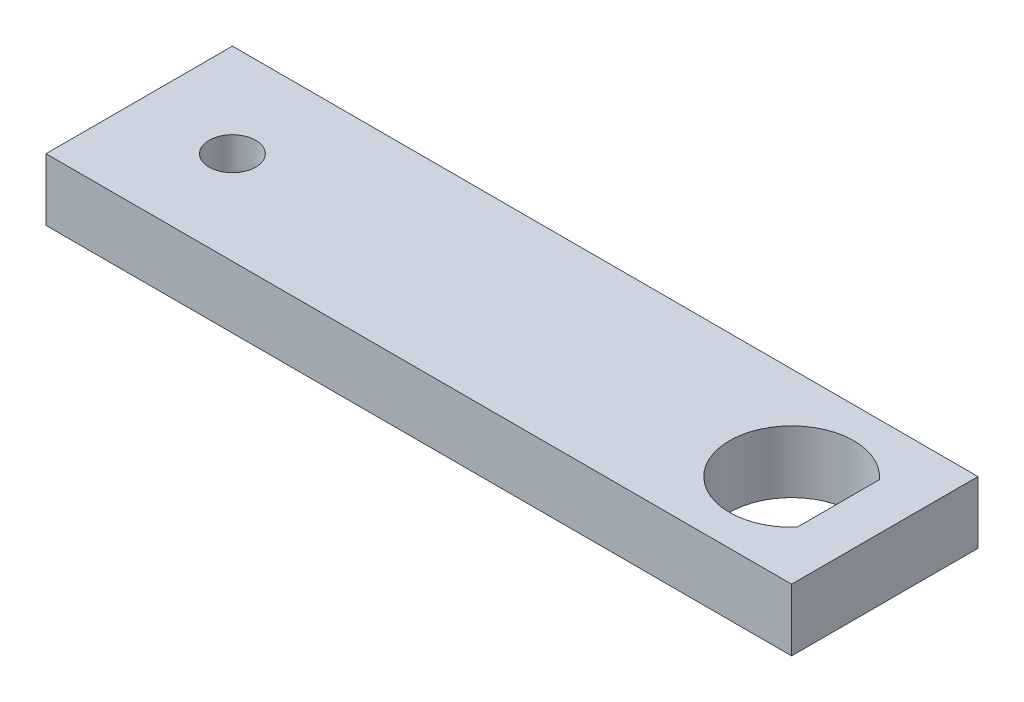
ISO-10303-21;
HEADER;
FILE_DESCRIPTION(('STEP AP214'),'2;1');
FILE_NAME('part.step','',(''),(''),'','','');
FILE_SCHEMA(('AUTOMOTIVE_DESIGN { 1 0 10303 214 1 1 1 1 }'));
ENDSEC;
DATA;
#1=APPLICATION_CONTEXT('core data for automotive mechanical design processes');
#2=APPLICATION_PROTOCOL_DEFINITION('international standard','automotive_design',2000,#1);
#3=PRODUCT_CONTEXT('',#1,'mechanical');
#4=PRODUCT('Part','Part','',(#3));
#5=PRODUCT_RELATED_PRODUCT_CATEGORY('part','',(#4));
#6=PRODUCT_DEFINITION_FORMATION('','',#4);
#7=PRODUCT_DEFINITION_CONTEXT('part definition',#1,'design');
#8=PRODUCT_DEFINITION('design','',#6,#7);
#9=PRODUCT_DEFINITION_SHAPE('','',#8);
#10=(LENGTH_UNIT() NAMED_UNIT(*) SI_UNIT(.MILLI.,.METRE.));
#11=(NAMED_UNIT(*) PLANE_ANGLE_UNIT() SI_UNIT($,.RADIAN.));
#12=(NAMED_UNIT(*) SI_UNIT($,.STERADIAN.) SOLID_ANGLE_UNIT());
#13=UNCERTAINTY_MEASURE_WITH_UNIT(LENGTH_MEASURE(1.E-05),#10,'distance_accuracy_value','');
#14=(GEOMETRIC_REPRESENTATION_CONTEXT(3) GLOBAL_UNCERTAINTY_ASSIGNED_CONTEXT((#13)) GLOBAL_UNIT_ASSIGNED_CONTEXT((#10,
#11,#12)) REPRESENTATION_CONTEXT('',''));
#15=CARTESIAN_POINT('',(0.,0.,0.));
#16=DIRECTION('',(0.,0.,1.));
#17=DIRECTION('',(1.,0.,0.));
#18=AXIS2_PLACEMENT_3D('',#15,#16,#17);
#19=CARTESIAN_POINT('',(0.,0.,19.05));
#20=DIRECTION('',(-1.,0.,0.));
#21=DIRECTION('',(0.,0.,1.));
#22=AXIS2_PLACEMENT_3D('',#19,#20,#21);
#23=PLANE('',#22);
#24=DIRECTION('',(0.,1.,0.));
#25=VECTOR('',#24,1.);
#26=CARTESIAN_POINT('',(0.,0.,0.));
#27=LINE('',#26,#25);
#28=CARTESIAN_POINT('',(0.,0.,0.));
#29=VERTEX_POINT('',#28);
#30=CARTESIAN_POINT('',(0.,6.35000000000001,0.));
#31=VERTEX_POINT('',#30);
#32=EDGE_CURVE('E91',#29,#31,#27,.T.);
#33=ORIENTED_EDGE('',*,*,#32,.F.);
#34=DIRECTION('',(0.,0.,-1.));
#35=VECTOR('',#34,1.);
#36=CARTESIAN_POINT('',(0.,0.,19.05));
#37=LINE('',#36,#35);
#38=CARTESIAN_POINT('',(0.,0.,19.05));
#39=VERTEX_POINT('',#38);
#40=EDGE_CURVE('E11',#39,#29,#37,.T.);
#41=ORIENTED_EDGE('',*,*,#40,.F.);
#42=DIRECTION('',(0.,1.,0.));
#43=VECTOR('',#42,1.);
#44=CARTESIAN_POINT('',(0.,0.,19.05));
#45=LINE('',#44,#43);
#46=CARTESIAN_POINT('',(0.,6.35000000000001,19.05));
#47=VERTEX_POINT('',#46);
#48=EDGE_CURVE('E123',#39,#47,#45,.T.);
#49=ORIENTED_EDGE('',*,*,#48,.T.);
#50=DIRECTION('',(0.,0.,-1.));
#51=VECTOR('',#50,1.);
#52=CARTESIAN_POINT('',(0.,6.35000000000001,19.05));
#53=LINE('',#52,#51);
#54=EDGE_CURVE('E39',#47,#31,#53,.T.);
#55=ORIENTED_EDGE('',*,*,#54,.T.);
#56=EDGE_LOOP('',(#33,#41,#49,#55));
#57=FACE_BOUND('',#56,.T.);
#58=ADVANCED_FACE('F36',(#57),#23,.T.);
#59=CARTESIAN_POINT('',(0.,0.,19.05));
#60=DIRECTION('',(0.,1.,0.));
#61=DIRECTION('',(-1.,0.,0.));
#62=AXIS2_PLACEMENT_3D('',#59,#60,#61);
#63=PLANE('',#62);
#64=CARTESIAN_POINT('',(9.525,0.,9.525));
#65=DIRECTION('',(0.,1.,0.));
#66=DIRECTION('',(-1.,0.,0.));
#67=AXIS2_PLACEMENT_3D('',#64,#65,#66);
#68=CIRCLE('',#67,2.38125);
#69=CARTESIAN_POINT('',(7.14375,0.,9.525));
#70=VERTEX_POINT('',#69);
#71=EDGE_CURVE('E101',#70,#70,#68,.T.);
#72=ORIENTED_EDGE('',*,*,#71,.T.);
#73=EDGE_LOOP('',(#72));
#74=FACE_BOUND('',#73,.T.);
#75=DIRECTION('',(0.,0.,1.));
#76=VECTOR('',#75,1.);
#77=CARTESIAN_POINT('',(71.4375,0.,5.32486979368495));
#78=LINE('',#77,#76);
#79=CARTESIAN_POINT('',(71.4375,0.,5.32486979368495));
#80=VERTEX_POINT('',#79);
#81=CARTESIAN_POINT('',(71.4375,0.,13.7251302063151));
#82=VERTEX_POINT('',#81);
#83=EDGE_CURVE('E109',#80,#82,#78,.T.);
#84=ORIENTED_EDGE('',*,*,#83,.F.);
#85=CARTESIAN_POINT('',(66.675,0.,9.525));
#86=DIRECTION('',(0.,1.,0.));
#87=DIRECTION('',(-1.,0.,0.));
#88=AXIS2_PLACEMENT_3D('',#85,#86,#87);
#89=CIRCLE('',#88,6.35);
#90=EDGE_CURVE('E52',#80,#82,#89,.T.);
#91=ORIENTED_EDGE('',*,*,#90,.T.);
#92=EDGE_LOOP('',(#84,#91));
#93=FACE_BOUND('',#92,.T.);
#94=DIRECTION('',(1.,0.,0.));
#95=VECTOR('',#94,1.);
#96=CARTESIAN_POINT('',(0.,0.,0.));
#97=LINE('',#96,#95);
#98=CARTESIAN_POINT('',(76.2,0.,0.));
#99=VERTEX_POINT('',#98);
#100=EDGE_CURVE('E120',#29,#99,#97,.T.);
#101=ORIENTED_EDGE('',*,*,#100,.T.);
#102=DIRECTION('',(0.,0.,-1.));
#103=VECTOR('',#102,1.);
#104=CARTESIAN_POINT('',(76.2,0.,19.05));
#105=LINE('',#104,#103);
#106=CARTESIAN_POINT('',(76.2,0.,19.05));
#107=VERTEX_POINT('',#106);
#108=EDGE_CURVE('E44',#107,#99,#105,.T.);
#109=ORIENTED_EDGE('',*,*,#108,.F.);
#110=DIRECTION('',(1.,0.,0.));
#111=VECTOR('',#110,1.);
#112=CARTESIAN_POINT('',(0.,0.,19.05));
#113=LINE('',#112,#111);
#114=EDGE_CURVE('E131',#39,#107,#113,.T.);
#115=ORIENTED_EDGE('',*,*,#114,.F.);
#116=ORIENTED_EDGE('',*,*,#40,.T.);
#117=EDGE_LOOP('',(#101,#109,#115,#116));
#118=FACE_BOUND('',#117,.T.);
#119=ADVANCED_FACE('F146',(#74,#93,#118),#63,.F.);
#120=CARTESIAN_POINT('',(76.2,6.35,19.05));
#121=DIRECTION('',(1.,0.,0.));
#122=DIRECTION('',(0.,0.,-1.));
#123=AXIS2_PLACEMENT_3D('',#120,#121,#122);
#124=PLANE('',#123);
#125=DIRECTION('',(0.,-1.,0.));
#126=VECTOR('',#125,1.);
#127=CARTESIAN_POINT('',(76.2,6.35,0.));
#128=LINE('',#127,#126);
#129=CARTESIAN_POINT('',(76.2,6.35,0.));
#130=VERTEX_POINT('',#129);
#131=EDGE_CURVE('E117',#130,#99,#128,.T.);
#132=ORIENTED_EDGE('',*,*,#131,.F.);
#133=DIRECTION('',(0.,0.,-1.));
#134=VECTOR('',#133,1.);
#135=CARTESIAN_POINT('',(76.2,6.35,19.05));
#136=LINE('',#135,#134);
#137=CARTESIAN_POINT('',(76.2,6.35,19.05));
#138=VERTEX_POINT('',#137);
#139=EDGE_CURVE('E133',#138,#130,#136,.T.);
#140=ORIENTED_EDGE('',*,*,#139,.F.);
#141=DIRECTION('',(0.,-1.,0.));
#142=VECTOR('',#141,1.);
#143=CARTESIAN_POINT('',(76.2,6.35,19.05));
#144=LINE('',#143,#142);
#145=EDGE_CURVE('E128',#138,#107,#144,.T.);
#146=ORIENTED_EDGE('',*,*,#145,.T.);
#147=ORIENTED_EDGE('',*,*,#108,.T.);
#148=EDGE_LOOP('',(#132,#140,#146,#147));
#149=FACE_BOUND('',#148,.T.);
#150=ADVANCED_FACE('F152',(#149),#124,.T.);
#151=CARTESIAN_POINT('',(76.2,6.35,19.05));
#152=DIRECTION('',(0.,-1.,0.));
#153=DIRECTION('',(1.,0.,0.));
#154=AXIS2_PLACEMENT_3D('',#151,#152,#153);
#155=PLANE('',#154);
#156=CARTESIAN_POINT('',(9.525,6.35000000000001,9.525));
#157=DIRECTION('',(0.,1.,0.));
#158=DIRECTION('',(-1.,0.,0.));
#159=AXIS2_PLACEMENT_3D('',#156,#157,#158);
#160=CIRCLE('',#159,2.38125);
#161=CARTESIAN_POINT('',(7.14375,6.35000000000001,9.525));
#162=VERTEX_POINT('',#161);
#163=EDGE_CURVE('E104',#162,#162,#160,.T.);
#164=ORIENTED_EDGE('',*,*,#163,.F.);
#165=EDGE_LOOP('',(#164));
#166=FACE_BOUND('',#165,.T.);
#167=DIRECTION('',(0.,0.,1.));
#168=VECTOR('',#167,1.);
#169=CARTESIAN_POINT('',(71.4375,6.35,5.32486979368495));
#170=LINE('',#169,#168);
#171=CARTESIAN_POINT('',(71.4375,6.35,5.32486979368495));
#172=VERTEX_POINT('',#171);
#173=CARTESIAN_POINT('',(71.4375,6.35,13.7251302063151));
#174=VERTEX_POINT('',#173);
#175=EDGE_CURVE('E95',#172,#174,#170,.T.);
#176=ORIENTED_EDGE('',*,*,#175,.T.);
#177=CARTESIAN_POINT('',(66.675,6.35,9.525));
#178=DIRECTION('',(0.,1.,0.));
#179=DIRECTION('',(-1.,0.,0.));
#180=AXIS2_PLACEMENT_3D('',#177,#178,#179);
#181=CIRCLE('',#180,6.35);
#182=EDGE_CURVE('E57',#172,#174,#181,.T.);
#183=ORIENTED_EDGE('',*,*,#182,.F.);
#184=EDGE_LOOP('',(#176,#183));
#185=FACE_BOUND('',#184,.T.);
#186=DIRECTION('',(-1.,0.,0.));
#187=VECTOR('',#186,1.);
#188=CARTESIAN_POINT('',(76.2,6.35,0.));
#189=LINE('',#188,#187);
#190=EDGE_CURVE('E114',#130,#31,#189,.T.);
#191=ORIENTED_EDGE('',*,*,#190,.T.);
#192=ORIENTED_EDGE('',*,*,#54,.F.);
#193=DIRECTION('',(-1.,0.,0.));
#194=VECTOR('',#193,1.);
#195=CARTESIAN_POINT('',(76.2,6.35,19.05));
#196=LINE('',#195,#194);
#197=EDGE_CURVE('E126',#138,#47,#196,.T.);
#198=ORIENTED_EDGE('',*,*,#197,.F.);
#199=ORIENTED_EDGE('',*,*,#139,.T.);
#200=EDGE_LOOP('',(#191,#192,#198,#199));
#201=FACE_BOUND('',#200,.T.);
#202=ADVANCED_FACE('F99',(#166,#185,#201),#155,.F.);
#203=CARTESIAN_POINT('',(0.,0.,19.05));
#204=DIRECTION('',(0.,0.,-1.));
#205=DIRECTION('',(-1.,0.,0.));
#206=AXIS2_PLACEMENT_3D('',#203,#204,#205);
#207=PLANE('',#206);
#208=ORIENTED_EDGE('',*,*,#48,.F.);
#209=ORIENTED_EDGE('',*,*,#114,.T.);
#210=ORIENTED_EDGE('',*,*,#145,.F.);
#211=ORIENTED_EDGE('',*,*,#197,.T.);
#212=EDGE_LOOP('',(#208,#209,#210,#211));
#213=FACE_BOUND('',#212,.T.);
#214=ADVANCED_FACE('F150',(#213),#207,.F.);
#215=CARTESIAN_POINT('',(0.,0.,0.));
#216=DIRECTION('',(0.,0.,-1.));
#217=DIRECTION('',(-1.,0.,0.));
#218=AXIS2_PLACEMENT_3D('',#215,#216,#217);
#219=PLANE('',#218);
#220=ORIENTED_EDGE('',*,*,#32,.T.);
#221=ORIENTED_EDGE('',*,*,#190,.F.);
#222=ORIENTED_EDGE('',*,*,#131,.T.);
#223=ORIENTED_EDGE('',*,*,#100,.F.);
#224=EDGE_LOOP('',(#220,#221,#222,#223));
#225=FACE_BOUND('',#224,.T.);
#226=ADVANCED_FACE('F143',(#225),#219,.T.);
#227=CARTESIAN_POINT('',(66.675,0.,9.525));
#228=DIRECTION('',(0.,1.,0.));
#229=DIRECTION('',(-1.,0.,0.));
#230=AXIS2_PLACEMENT_3D('',#227,#228,#229);
#231=CYLINDRICAL_SURFACE('',#230,6.35);
#232=ORIENTED_EDGE('',*,*,#182,.T.);
#233=DIRECTION('',(0.,1.,0.));
#234=VECTOR('',#233,1.);
#235=CARTESIAN_POINT('',(71.4375,0.,13.7251302063151));
#236=LINE('',#235,#234);
#237=EDGE_CURVE('E92',#82,#174,#236,.T.);
#238=ORIENTED_EDGE('',*,*,#237,.F.);
#239=ORIENTED_EDGE('',*,*,#90,.F.);
#240=DIRECTION('',(0.,1.,0.));
#241=VECTOR('',#240,1.);
#242=CARTESIAN_POINT('',(71.4375,0.,5.32486979368495));
#243=LINE('',#242,#241);
#244=EDGE_CURVE('E86',#80,#172,#243,.T.);
#245=ORIENTED_EDGE('',*,*,#244,.T.);
#246=EDGE_LOOP('',(#232,#238,#239,#245));
#247=FACE_BOUND('',#246,.T.);
#248=ADVANCED_FACE('F88',(#247),#231,.F.);
#249=CARTESIAN_POINT('',(71.4375,0.,5.32486979368495));
#250=DIRECTION('',(-1.,0.,0.));
#251=DIRECTION('',(0.,-1.,0.));
#252=AXIS2_PLACEMENT_3D('',#249,#250,#251);
#253=PLANE('',#252);
#254=ORIENTED_EDGE('',*,*,#175,.F.);
#255=ORIENTED_EDGE('',*,*,#244,.F.);
#256=ORIENTED_EDGE('',*,*,#83,.T.);
#257=ORIENTED_EDGE('',*,*,#237,.T.);
#258=EDGE_LOOP('',(#254,#255,#256,#257));
#259=FACE_BOUND('',#258,.T.);
#260=ADVANCED_FACE('F96',(#259),#253,.T.);
#261=CARTESIAN_POINT('',(9.525,0.,9.525));
#262=DIRECTION('',(0.,1.,0.));
#263=DIRECTION('',(-1.,0.,0.));
#264=AXIS2_PLACEMENT_3D('',#261,#262,#263);
#265=CYLINDRICAL_SURFACE('',#264,2.38125);
#266=ORIENTED_EDGE('',*,*,#71,.F.);
#267=EDGE_LOOP('',(#266));
#268=FACE_BOUND('',#267,.T.);
#269=ORIENTED_EDGE('',*,*,#163,.T.);
#270=EDGE_LOOP('',(#269));
#271=FACE_BOUND('',#270,.T.);
#272=ADVANCED_FACE('F188',(#268,#271),#265,.F.);
#273=CLOSED_SHELL('',(#58,#119,#150,#202,#214,#226,#248,#260,#272));
#274=MANIFOLD_SOLID_BREP('B2',#273);
#275=ADVANCED_BREP_SHAPE_REPRESENTATION('',(#18,#274),#14);
#276=SHAPE_DEFINITION_REPRESENTATION(#9,#275);
ENDSEC;
END-ISO-10303-21;
